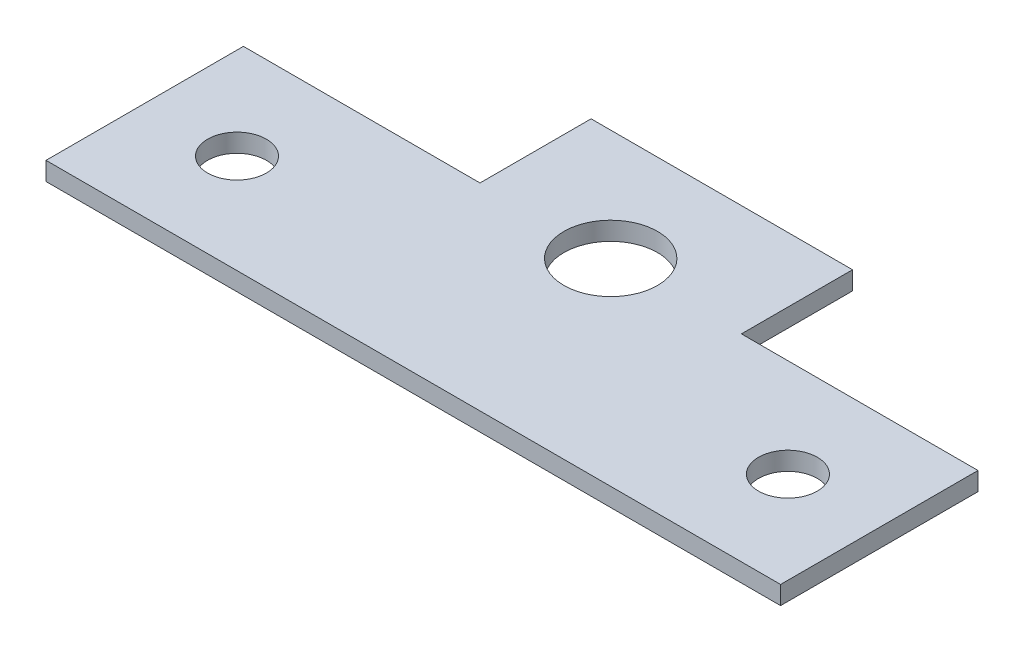
ISO-10303-21;
HEADER;
FILE_DESCRIPTION(('STEP AP214'),'2;1');
FILE_NAME('part.step','',(''),(''),'','','');
FILE_SCHEMA(('AUTOMOTIVE_DESIGN { 1 0 10303 214 1 1 1 1 }'));
ENDSEC;
DATA;
#1=APPLICATION_CONTEXT('core data for automotive mechanical design processes');
#2=APPLICATION_PROTOCOL_DEFINITION('international standard','automotive_design',2000,#1);
#3=PRODUCT_CONTEXT('',#1,'mechanical');
#4=PRODUCT('Part','Part','',(#3));
#5=PRODUCT_RELATED_PRODUCT_CATEGORY('part','',(#4));
#6=PRODUCT_DEFINITION_FORMATION('','',#4);
#7=PRODUCT_DEFINITION_CONTEXT('part definition',#1,'design');
#8=PRODUCT_DEFINITION('design','',#6,#7);
#9=PRODUCT_DEFINITION_SHAPE('','',#8);
#10=(LENGTH_UNIT() NAMED_UNIT(*) SI_UNIT(.MILLI.,.METRE.));
#11=(NAMED_UNIT(*) PLANE_ANGLE_UNIT() SI_UNIT($,.RADIAN.));
#12=(NAMED_UNIT(*) SI_UNIT($,.STERADIAN.) SOLID_ANGLE_UNIT());
#13=UNCERTAINTY_MEASURE_WITH_UNIT(LENGTH_MEASURE(1.E-05),#10,'distance_accuracy_value','');
#14=(GEOMETRIC_REPRESENTATION_CONTEXT(3) GLOBAL_UNCERTAINTY_ASSIGNED_CONTEXT((#13)) GLOBAL_UNIT_ASSIGNED_CONTEXT((#10,
#11,#12)) REPRESENTATION_CONTEXT('',''));
#15=CARTESIAN_POINT('',(0.,0.,0.));
#16=DIRECTION('',(0.,0.,1.));
#17=DIRECTION('',(1.,0.,0.));
#18=AXIS2_PLACEMENT_3D('',#15,#16,#17);
#19=CARTESIAN_POINT('',(-20.,1.,-8.4));
#20=DIRECTION('',(1.,0.,0.));
#21=DIRECTION('',(0.,0.,-1.));
#22=AXIS2_PLACEMENT_3D('',#19,#20,#21);
#23=PLANE('',#22);
#24=DIRECTION('',(0.,0.,1.));
#25=VECTOR('',#24,1.);
#26=CARTESIAN_POINT('',(-20.,1.,-8.4));
#27=LINE('',#26,#25);
#28=CARTESIAN_POINT('',(-20.,1.,-2.35));
#29=VERTEX_POINT('',#28);
#30=CARTESIAN_POINT('',(-20.,1.,8.4));
#31=VERTEX_POINT('',#30);
#32=EDGE_CURVE('E131',#29,#31,#27,.T.);
#33=ORIENTED_EDGE('',*,*,#32,.F.);
#34=DIRECTION('',(0.,1.,0.));
#35=VECTOR('',#34,1.);
#36=CARTESIAN_POINT('',(-20.,0.,-2.35));
#37=LINE('',#36,#35);
#38=CARTESIAN_POINT('',(-20.,0.,-2.35));
#39=VERTEX_POINT('',#38);
#40=EDGE_CURVE('E169',#39,#29,#37,.T.);
#41=ORIENTED_EDGE('',*,*,#40,.F.);
#42=DIRECTION('',(0.,0.,1.));
#43=VECTOR('',#42,1.);
#44=CARTESIAN_POINT('',(-20.,0.,-8.4));
#45=LINE('',#44,#43);
#46=CARTESIAN_POINT('',(-20.,0.,8.4));
#47=VERTEX_POINT('',#46);
#48=EDGE_CURVE('E135',#39,#47,#45,.T.);
#49=ORIENTED_EDGE('',*,*,#48,.T.);
#50=DIRECTION('',(0.,-1.,0.));
#51=VECTOR('',#50,1.);
#52=CARTESIAN_POINT('',(-20.,1.,8.4));
#53=LINE('',#52,#51);
#54=EDGE_CURVE('E11',#31,#47,#53,.T.);
#55=ORIENTED_EDGE('',*,*,#54,.F.);
#56=EDGE_LOOP('',(#33,#41,#49,#55));
#57=FACE_BOUND('',#56,.T.);
#58=ADVANCED_FACE('F39',(#57),#23,.F.);
#59=CARTESIAN_POINT('',(-20.,1.,8.4));
#60=DIRECTION('',(0.,0.,-1.));
#61=DIRECTION('',(-1.,0.,0.));
#62=AXIS2_PLACEMENT_3D('',#59,#60,#61);
#63=PLANE('',#62);
#64=DIRECTION('',(1.,0.,0.));
#65=VECTOR('',#64,1.);
#66=CARTESIAN_POINT('',(-20.,0.,8.4));
#67=LINE('',#66,#65);
#68=CARTESIAN_POINT('',(20.,0.,8.4));
#69=VERTEX_POINT('',#68);
#70=EDGE_CURVE('E137',#47,#69,#67,.T.);
#71=ORIENTED_EDGE('',*,*,#70,.T.);
#72=DIRECTION('',(0.,-1.,0.));
#73=VECTOR('',#72,1.);
#74=CARTESIAN_POINT('',(20.,1.,8.4));
#75=LINE('',#74,#73);
#76=CARTESIAN_POINT('',(20.,1.,8.4));
#77=VERTEX_POINT('',#76);
#78=EDGE_CURVE('E46',#77,#69,#75,.T.);
#79=ORIENTED_EDGE('',*,*,#78,.F.);
#80=DIRECTION('',(1.,0.,0.));
#81=VECTOR('',#80,1.);
#82=CARTESIAN_POINT('',(-20.,1.,8.4));
#83=LINE('',#82,#81);
#84=EDGE_CURVE('E125',#31,#77,#83,.T.);
#85=ORIENTED_EDGE('',*,*,#84,.F.);
#86=ORIENTED_EDGE('',*,*,#54,.T.);
#87=EDGE_LOOP('',(#71,#79,#85,#86));
#88=FACE_BOUND('',#87,.T.);
#89=ADVANCED_FACE('F146',(#88),#63,.F.);
#90=CARTESIAN_POINT('',(20.,1.,-8.4));
#91=DIRECTION('',(1.,0.,0.));
#92=DIRECTION('',(0.,0.,-1.));
#93=AXIS2_PLACEMENT_3D('',#90,#91,#92);
#94=PLANE('',#93);
#95=DIRECTION('',(0.,1.,0.));
#96=VECTOR('',#95,1.);
#97=CARTESIAN_POINT('',(20.,0.,-2.35));
#98=LINE('',#97,#96);
#99=CARTESIAN_POINT('',(20.,0.,-2.35));
#100=VERTEX_POINT('',#99);
#101=CARTESIAN_POINT('',(20.,1.,-2.35));
#102=VERTEX_POINT('',#101);
#103=EDGE_CURVE('E104',#100,#102,#98,.T.);
#104=ORIENTED_EDGE('',*,*,#103,.T.);
#105=DIRECTION('',(0.,0.,1.));
#106=VECTOR('',#105,1.);
#107=CARTESIAN_POINT('',(20.,1.,-8.4));
#108=LINE('',#107,#106);
#109=EDGE_CURVE('E117',#102,#77,#108,.T.);
#110=ORIENTED_EDGE('',*,*,#109,.T.);
#111=ORIENTED_EDGE('',*,*,#78,.T.);
#112=DIRECTION('',(0.,0.,1.));
#113=VECTOR('',#112,1.);
#114=CARTESIAN_POINT('',(20.,0.,-8.4));
#115=LINE('',#114,#113);
#116=EDGE_CURVE('E119',#100,#69,#115,.T.);
#117=ORIENTED_EDGE('',*,*,#116,.F.);
#118=EDGE_LOOP('',(#104,#110,#111,#117));
#119=FACE_BOUND('',#118,.T.);
#120=ADVANCED_FACE('F115',(#119),#94,.T.);
#121=CARTESIAN_POINT('',(-20.,1.,-8.4));
#122=DIRECTION('',(0.,0.,-1.));
#123=DIRECTION('',(-1.,0.,0.));
#124=AXIS2_PLACEMENT_3D('',#121,#122,#123);
#125=PLANE('',#124);
#126=DIRECTION('',(0.,1.,0.));
#127=VECTOR('',#126,1.);
#128=CARTESIAN_POINT('',(7.11750738841597,0.,-8.4));
#129=LINE('',#128,#127);
#130=CARTESIAN_POINT('',(7.11750738841597,0.,-8.4));
#131=VERTEX_POINT('',#130);
#132=CARTESIAN_POINT('',(7.11750738841597,1.,-8.4));
#133=VERTEX_POINT('',#132);
#134=EDGE_CURVE('E153',#131,#133,#129,.T.);
#135=ORIENTED_EDGE('',*,*,#134,.F.);
#136=DIRECTION('',(1.,0.,0.));
#137=VECTOR('',#136,1.);
#138=CARTESIAN_POINT('',(-20.,0.,-8.4));
#139=LINE('',#138,#137);
#140=CARTESIAN_POINT('',(-7.11750738841597,0.,-8.4));
#141=VERTEX_POINT('',#140);
#142=EDGE_CURVE('E142',#141,#131,#139,.T.);
#143=ORIENTED_EDGE('',*,*,#142,.F.);
#144=DIRECTION('',(0.,1.,0.));
#145=VECTOR('',#144,1.);
#146=CARTESIAN_POINT('',(-7.11750738841597,0.,-8.4));
#147=LINE('',#146,#145);
#148=CARTESIAN_POINT('',(-7.11750738841597,1.,-8.4));
#149=VERTEX_POINT('',#148);
#150=EDGE_CURVE('E138',#141,#149,#147,.T.);
#151=ORIENTED_EDGE('',*,*,#150,.T.);
#152=DIRECTION('',(1.,0.,0.));
#153=VECTOR('',#152,1.);
#154=CARTESIAN_POINT('',(-20.,1.,-8.4));
#155=LINE('',#154,#153);
#156=EDGE_CURVE('E127',#149,#133,#155,.T.);
#157=ORIENTED_EDGE('',*,*,#156,.T.);
#158=EDGE_LOOP('',(#135,#143,#151,#157));
#159=FACE_BOUND('',#158,.T.);
#160=ADVANCED_FACE('F188',(#159),#125,.T.);
#161=CARTESIAN_POINT('',(0.,1.,0.));
#162=DIRECTION('',(0.,1.,0.));
#163=DIRECTION('',(0.,0.,1.));
#164=AXIS2_PLACEMENT_3D('',#161,#162,#163);
#165=PLANE('',#164);
#166=DIRECTION('',(1.,0.,0.));
#167=VECTOR('',#166,1.);
#168=CARTESIAN_POINT('',(20.,1.,-2.35));
#169=LINE('',#168,#167);
#170=CARTESIAN_POINT('',(7.11750738841597,1.,-2.35));
#171=VERTEX_POINT('',#170);
#172=EDGE_CURVE('E101',#171,#102,#169,.T.);
#173=ORIENTED_EDGE('',*,*,#172,.F.);
#174=DIRECTION('',(0.,0.,1.));
#175=VECTOR('',#174,1.);
#176=CARTESIAN_POINT('',(7.11750738841597,1.,-8.4));
#177=LINE('',#176,#175);
#178=EDGE_CURVE('E110',#133,#171,#177,.T.);
#179=ORIENTED_EDGE('',*,*,#178,.F.);
#180=ORIENTED_EDGE('',*,*,#156,.F.);
#181=DIRECTION('',(0.,0.,-1.));
#182=VECTOR('',#181,1.);
#183=CARTESIAN_POINT('',(-7.11750738841597,1.,-8.4));
#184=LINE('',#183,#182);
#185=CARTESIAN_POINT('',(-7.11750738841597,1.,-2.35));
#186=VERTEX_POINT('',#185);
#187=EDGE_CURVE('E167',#186,#149,#184,.T.);
#188=ORIENTED_EDGE('',*,*,#187,.F.);
#189=DIRECTION('',(1.,0.,0.));
#190=VECTOR('',#189,1.);
#191=CARTESIAN_POINT('',(-20.,1.,-2.35));
#192=LINE('',#191,#190);
#193=EDGE_CURVE('E170',#29,#186,#192,.T.);
#194=ORIENTED_EDGE('',*,*,#193,.F.);
#195=ORIENTED_EDGE('',*,*,#32,.T.);
#196=ORIENTED_EDGE('',*,*,#84,.T.);
#197=ORIENTED_EDGE('',*,*,#109,.F.);
#198=EDGE_LOOP('',(#173,#179,#180,#188,#194,#195,#196,#197));
#199=FACE_BOUND('',#198,.T.);
#200=CARTESIAN_POINT('',(-15.,1.,3.));
#201=DIRECTION('',(0.,1.,0.));
#202=DIRECTION('',(0.,0.,1.));
#203=AXIS2_PLACEMENT_3D('',#200,#201,#202);
#204=CIRCLE('',#203,1.6);
#205=CARTESIAN_POINT('',(-15.,1.,4.6));
#206=VERTEX_POINT('',#205);
#207=EDGE_CURVE('E120',#206,#206,#204,.T.);
#208=ORIENTED_EDGE('',*,*,#207,.F.);
#209=EDGE_LOOP('',(#208));
#210=FACE_BOUND('',#209,.T.);
#211=CARTESIAN_POINT('',(15.,1.,3.));
#212=DIRECTION('',(0.,1.,0.));
#213=DIRECTION('',(0.,0.,-1.));
#214=AXIS2_PLACEMENT_3D('',#211,#212,#213);
#215=CIRCLE('',#214,1.6);
#216=CARTESIAN_POINT('',(15.,1.,1.4));
#217=VERTEX_POINT('',#216);
#218=EDGE_CURVE('E164',#217,#217,#215,.T.);
#219=ORIENTED_EDGE('',*,*,#218,.F.);
#220=EDGE_LOOP('',(#219));
#221=FACE_BOUND('',#220,.T.);
#222=CARTESIAN_POINT('',(0.,1.,-2.35));
#223=DIRECTION('',(0.,1.,0.));
#224=DIRECTION('',(0.,0.,1.));
#225=AXIS2_PLACEMENT_3D('',#222,#223,#224);
#226=CIRCLE('',#225,2.55);
#227=CARTESIAN_POINT('',(0.,1.,0.2));
#228=VERTEX_POINT('',#227);
#229=EDGE_CURVE('E337',#228,#228,#226,.T.);
#230=ORIENTED_EDGE('',*,*,#229,.F.);
#231=EDGE_LOOP('',(#230));
#232=FACE_BOUND('',#231,.T.);
#233=ADVANCED_FACE('F122',(#199,#210,#221,#232),#165,.T.);
#234=CARTESIAN_POINT('',(0.,0.,0.));
#235=DIRECTION('',(0.,1.,0.));
#236=DIRECTION('',(0.,0.,1.));
#237=AXIS2_PLACEMENT_3D('',#234,#235,#236);
#238=PLANE('',#237);
#239=CARTESIAN_POINT('',(-15.,0.,3.));
#240=DIRECTION('',(0.,1.,0.));
#241=DIRECTION('',(0.,0.,1.));
#242=AXIS2_PLACEMENT_3D('',#239,#240,#241);
#243=CIRCLE('',#242,1.6);
#244=CARTESIAN_POINT('',(-15.,0.,4.6));
#245=VERTEX_POINT('',#244);
#246=EDGE_CURVE('E161',#245,#245,#243,.T.);
#247=ORIENTED_EDGE('',*,*,#246,.T.);
#248=EDGE_LOOP('',(#247));
#249=FACE_BOUND('',#248,.T.);
#250=CARTESIAN_POINT('',(15.,0.,3.));
#251=DIRECTION('',(0.,1.,0.));
#252=DIRECTION('',(0.,0.,-1.));
#253=AXIS2_PLACEMENT_3D('',#250,#251,#252);
#254=CIRCLE('',#253,1.6);
#255=CARTESIAN_POINT('',(15.,0.,1.4));
#256=VERTEX_POINT('',#255);
#257=EDGE_CURVE('E339',#256,#256,#254,.T.);
#258=ORIENTED_EDGE('',*,*,#257,.T.);
#259=EDGE_LOOP('',(#258));
#260=FACE_BOUND('',#259,.T.);
#261=CARTESIAN_POINT('',(0.,0.,-2.35));
#262=DIRECTION('',(0.,1.,0.));
#263=DIRECTION('',(0.,0.,1.));
#264=AXIS2_PLACEMENT_3D('',#261,#262,#263);
#265=CIRCLE('',#264,2.55);
#266=CARTESIAN_POINT('',(0.,0.,0.2));
#267=VERTEX_POINT('',#266);
#268=EDGE_CURVE('E340',#267,#267,#265,.T.);
#269=ORIENTED_EDGE('',*,*,#268,.T.);
#270=EDGE_LOOP('',(#269));
#271=FACE_BOUND('',#270,.T.);
#272=DIRECTION('',(0.,0.,1.));
#273=VECTOR('',#272,1.);
#274=CARTESIAN_POINT('',(7.11750738841597,0.,-8.4));
#275=LINE('',#274,#273);
#276=CARTESIAN_POINT('',(7.11750738841597,0.,-2.35));
#277=VERTEX_POINT('',#276);
#278=EDGE_CURVE('E111',#131,#277,#275,.T.);
#279=ORIENTED_EDGE('',*,*,#278,.T.);
#280=DIRECTION('',(1.,0.,0.));
#281=VECTOR('',#280,1.);
#282=CARTESIAN_POINT('',(20.,0.,-2.35));
#283=LINE('',#282,#281);
#284=EDGE_CURVE('E53',#277,#100,#283,.T.);
#285=ORIENTED_EDGE('',*,*,#284,.T.);
#286=ORIENTED_EDGE('',*,*,#116,.T.);
#287=ORIENTED_EDGE('',*,*,#70,.F.);
#288=ORIENTED_EDGE('',*,*,#48,.F.);
#289=DIRECTION('',(1.,0.,0.));
#290=VECTOR('',#289,1.);
#291=CARTESIAN_POINT('',(-20.,0.,-2.35));
#292=LINE('',#291,#290);
#293=CARTESIAN_POINT('',(-7.11750738841597,0.,-2.35));
#294=VERTEX_POINT('',#293);
#295=EDGE_CURVE('E165',#39,#294,#292,.T.);
#296=ORIENTED_EDGE('',*,*,#295,.T.);
#297=DIRECTION('',(0.,0.,-1.));
#298=VECTOR('',#297,1.);
#299=CARTESIAN_POINT('',(-7.11750738841597,0.,-8.4));
#300=LINE('',#299,#298);
#301=EDGE_CURVE('E61',#294,#141,#300,.T.);
#302=ORIENTED_EDGE('',*,*,#301,.T.);
#303=ORIENTED_EDGE('',*,*,#142,.T.);
#304=EDGE_LOOP('',(#279,#285,#286,#287,#288,#296,#302,#303));
#305=FACE_BOUND('',#304,.T.);
#306=ADVANCED_FACE('F151',(#249,#260,#271,#305),#238,.F.);
#307=CARTESIAN_POINT('',(-7.11750738841597,0.,-8.4));
#308=DIRECTION('',(1.,0.,0.));
#309=DIRECTION('',(0.,0.,-1.));
#310=AXIS2_PLACEMENT_3D('',#307,#308,#309);
#311=PLANE('',#310);
#312=ORIENTED_EDGE('',*,*,#187,.T.);
#313=ORIENTED_EDGE('',*,*,#150,.F.);
#314=ORIENTED_EDGE('',*,*,#301,.F.);
#315=DIRECTION('',(0.,1.,0.));
#316=VECTOR('',#315,1.);
#317=CARTESIAN_POINT('',(-7.11750738841597,0.,-2.35));
#318=LINE('',#317,#316);
#319=EDGE_CURVE('E176',#294,#186,#318,.T.);
#320=ORIENTED_EDGE('',*,*,#319,.T.);
#321=EDGE_LOOP('',(#312,#313,#314,#320));
#322=FACE_BOUND('',#321,.T.);
#323=ADVANCED_FACE('F192',(#322),#311,.F.);
#324=CARTESIAN_POINT('',(-20.,0.,-2.35));
#325=DIRECTION('',(0.,0.,1.));
#326=DIRECTION('',(1.,0.,0.));
#327=AXIS2_PLACEMENT_3D('',#324,#325,#326);
#328=PLANE('',#327);
#329=ORIENTED_EDGE('',*,*,#193,.T.);
#330=ORIENTED_EDGE('',*,*,#319,.F.);
#331=ORIENTED_EDGE('',*,*,#295,.F.);
#332=ORIENTED_EDGE('',*,*,#40,.T.);
#333=EDGE_LOOP('',(#329,#330,#331,#332));
#334=FACE_BOUND('',#333,.T.);
#335=ADVANCED_FACE('F184',(#334),#328,.F.);
#336=CARTESIAN_POINT('',(0.,0.,-2.35));
#337=DIRECTION('',(0.,1.,0.));
#338=DIRECTION('',(0.,0.,1.));
#339=AXIS2_PLACEMENT_3D('',#336,#337,#338);
#340=CYLINDRICAL_SURFACE('',#339,2.55);
#341=ORIENTED_EDGE('',*,*,#268,.F.);
#342=EDGE_LOOP('',(#341));
#343=FACE_BOUND('',#342,.T.);
#344=ORIENTED_EDGE('',*,*,#229,.T.);
#345=EDGE_LOOP('',(#344));
#346=FACE_BOUND('',#345,.T.);
#347=ADVANCED_FACE('F199',(#343,#346),#340,.F.);
#348=CARTESIAN_POINT('',(15.,0.,3.));
#349=DIRECTION('',(0.,1.,0.));
#350=DIRECTION('',(0.,0.,1.));
#351=AXIS2_PLACEMENT_3D('',#348,#349,#350);
#352=CYLINDRICAL_SURFACE('',#351,1.6);
#353=ORIENTED_EDGE('',*,*,#257,.F.);
#354=EDGE_LOOP('',(#353));
#355=FACE_BOUND('',#354,.T.);
#356=ORIENTED_EDGE('',*,*,#218,.T.);
#357=EDGE_LOOP('',(#356));
#358=FACE_BOUND('',#357,.T.);
#359=ADVANCED_FACE('F246',(#355,#358),#352,.F.);
#360=CARTESIAN_POINT('',(-15.,0.,3.));
#361=DIRECTION('',(0.,1.,0.));
#362=DIRECTION('',(0.,0.,1.));
#363=AXIS2_PLACEMENT_3D('',#360,#361,#362);
#364=CYLINDRICAL_SURFACE('',#363,1.6);
#365=ORIENTED_EDGE('',*,*,#246,.F.);
#366=EDGE_LOOP('',(#365));
#367=FACE_BOUND('',#366,.T.);
#368=ORIENTED_EDGE('',*,*,#207,.T.);
#369=EDGE_LOOP('',(#368));
#370=FACE_BOUND('',#369,.T.);
#371=ADVANCED_FACE('F257',(#367,#370),#364,.F.);
#372=CARTESIAN_POINT('',(20.,0.,-2.35));
#373=DIRECTION('',(0.,0.,1.));
#374=DIRECTION('',(1.,0.,0.));
#375=AXIS2_PLACEMENT_3D('',#372,#373,#374);
#376=PLANE('',#375);
#377=ORIENTED_EDGE('',*,*,#172,.T.);
#378=ORIENTED_EDGE('',*,*,#103,.F.);
#379=ORIENTED_EDGE('',*,*,#284,.F.);
#380=DIRECTION('',(0.,1.,0.));
#381=VECTOR('',#380,1.);
#382=CARTESIAN_POINT('',(7.11750738841597,0.,-2.35));
#383=LINE('',#382,#381);
#384=EDGE_CURVE('E105',#277,#171,#383,.T.);
#385=ORIENTED_EDGE('',*,*,#384,.T.);
#386=EDGE_LOOP('',(#377,#378,#379,#385));
#387=FACE_BOUND('',#386,.T.);
#388=ADVANCED_FACE('F103',(#387),#376,.F.);
#389=CARTESIAN_POINT('',(7.11750738841597,0.,-8.4));
#390=DIRECTION('',(-1.,0.,0.));
#391=DIRECTION('',(0.,0.,1.));
#392=AXIS2_PLACEMENT_3D('',#389,#390,#391);
#393=PLANE('',#392);
#394=ORIENTED_EDGE('',*,*,#178,.T.);
#395=ORIENTED_EDGE('',*,*,#384,.F.);
#396=ORIENTED_EDGE('',*,*,#278,.F.);
#397=ORIENTED_EDGE('',*,*,#134,.T.);
#398=EDGE_LOOP('',(#394,#395,#396,#397));
#399=FACE_BOUND('',#398,.T.);
#400=ADVANCED_FACE('F191',(#399),#393,.F.);
#401=CLOSED_SHELL('',(#58,#89,#120,#160,#233,#306,#323,#335,#347,#359,#371,#388,#400));
#402=MANIFOLD_SOLID_BREP('B2',#401);
#403=ADVANCED_BREP_SHAPE_REPRESENTATION('',(#18,#402),#14);
#404=SHAPE_DEFINITION_REPRESENTATION(#9,#403);
ENDSEC;
END-ISO-10303-21;
